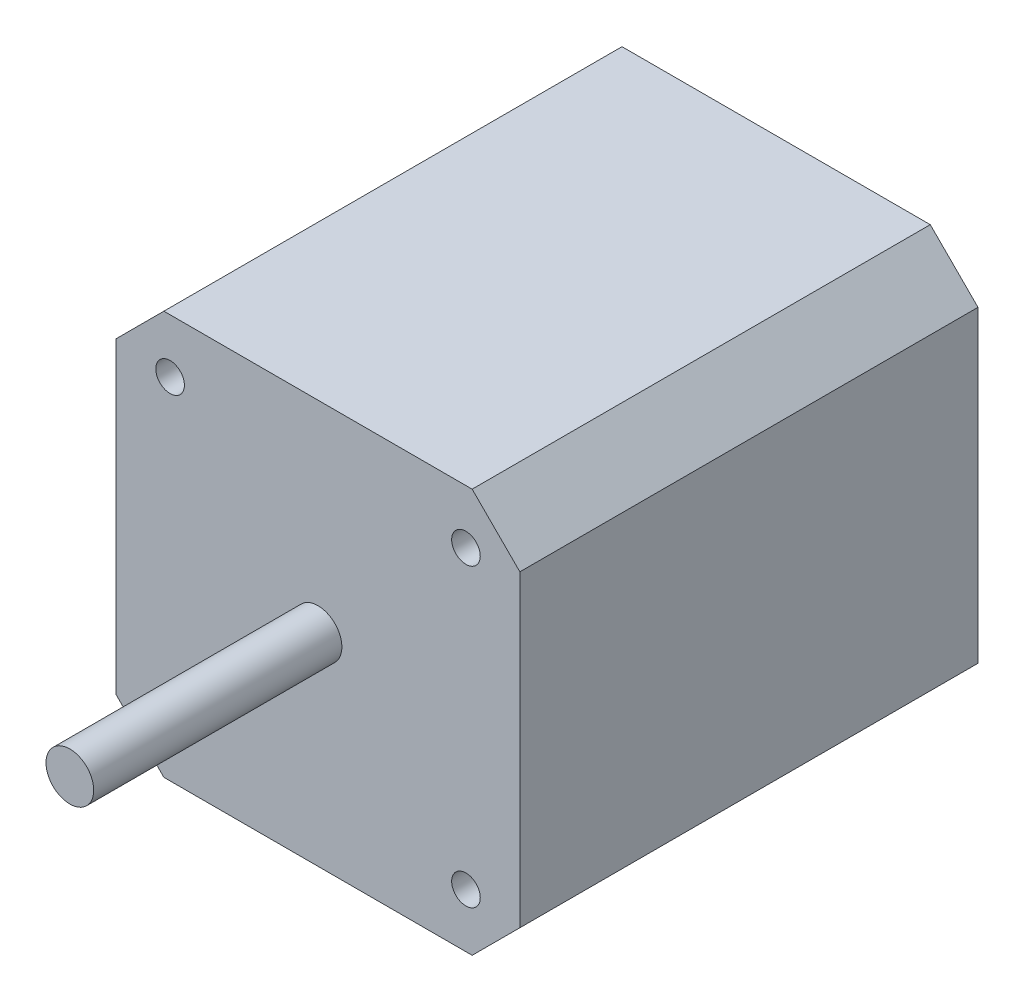
ISO-10303-21;
HEADER;
FILE_DESCRIPTION(('STEP AP214'),'2;1');
FILE_NAME('part.step','',(''),(''),'','','');
FILE_SCHEMA(('AUTOMOTIVE_DESIGN { 1 0 10303 214 1 1 1 1 }'));
ENDSEC;
DATA;
#1=APPLICATION_CONTEXT('core data for automotive mechanical design processes');
#2=APPLICATION_PROTOCOL_DEFINITION('international standard','automotive_design',2000,#1);
#3=PRODUCT_CONTEXT('',#1,'mechanical');
#4=PRODUCT('Part','Part','',(#3));
#5=PRODUCT_RELATED_PRODUCT_CATEGORY('part','',(#4));
#6=PRODUCT_DEFINITION_FORMATION('','',#4);
#7=PRODUCT_DEFINITION_CONTEXT('part definition',#1,'design');
#8=PRODUCT_DEFINITION('design','',#6,#7);
#9=PRODUCT_DEFINITION_SHAPE('','',#8);
#10=(LENGTH_UNIT() NAMED_UNIT(*) SI_UNIT(.MILLI.,.METRE.));
#11=(NAMED_UNIT(*) PLANE_ANGLE_UNIT() SI_UNIT($,.RADIAN.));
#12=(NAMED_UNIT(*) SI_UNIT($,.STERADIAN.) SOLID_ANGLE_UNIT());
#13=UNCERTAINTY_MEASURE_WITH_UNIT(LENGTH_MEASURE(1.E-05),#10,'distance_accuracy_value','');
#14=(GEOMETRIC_REPRESENTATION_CONTEXT(3) GLOBAL_UNCERTAINTY_ASSIGNED_CONTEXT((#13)) GLOBAL_UNIT_ASSIGNED_CONTEXT((#10,
#11,#12)) REPRESENTATION_CONTEXT('',''));
#15=CARTESIAN_POINT('',(0.,0.,0.));
#16=DIRECTION('',(0.,0.,1.));
#17=DIRECTION('',(1.,0.,0.));
#18=AXIS2_PLACEMENT_3D('',#15,#16,#17);
#19=CARTESIAN_POINT('',(-21.15,-21.15,48.));
#20=DIRECTION('',(0.,1.,0.));
#21=DIRECTION('',(0.,0.,1.));
#22=AXIS2_PLACEMENT_3D('',#19,#20,#21);
#23=PLANE('',#22);
#24=DIRECTION('',(0.,0.,-1.));
#25=VECTOR('',#24,1.);
#26=CARTESIAN_POINT('',(-1.14999999999997,-21.15,5.));
#27=LINE('',#26,#25);
#28=CARTESIAN_POINT('',(-1.14999999999997,-21.15,5.));
#29=VERTEX_POINT('',#28);
#30=CARTESIAN_POINT('',(-1.14999999999997,-21.15,0.));
#31=VERTEX_POINT('',#30);
#32=EDGE_CURVE('E144',#29,#31,#27,.T.);
#33=ORIENTED_EDGE('',*,*,#32,.F.);
#34=DIRECTION('',(1.,0.,0.));
#35=VECTOR('',#34,1.);
#36=CARTESIAN_POINT('',(1.14999999999997,-21.15,5.));
#37=LINE('',#36,#35);
#38=CARTESIAN_POINT('',(1.14999999999997,-21.15,5.));
#39=VERTEX_POINT('',#38);
#40=EDGE_CURVE('E130',#29,#39,#37,.T.);
#41=ORIENTED_EDGE('',*,*,#40,.T.);
#42=DIRECTION('',(0.,0.,-1.));
#43=VECTOR('',#42,1.);
#44=CARTESIAN_POINT('',(1.14999999999997,-21.15,5.));
#45=LINE('',#44,#43);
#46=CARTESIAN_POINT('',(1.14999999999997,-21.15,0.));
#47=VERTEX_POINT('',#46);
#48=EDGE_CURVE('E153',#39,#47,#45,.T.);
#49=ORIENTED_EDGE('',*,*,#48,.T.);
#50=DIRECTION('',(1.,0.,0.));
#51=VECTOR('',#50,1.);
#52=CARTESIAN_POINT('',(-21.15,-21.15,0.));
#53=LINE('',#52,#51);
#54=CARTESIAN_POINT('',(16.15,-21.15,0.));
#55=VERTEX_POINT('',#54);
#56=EDGE_CURVE('E184',#47,#55,#53,.T.);
#57=ORIENTED_EDGE('',*,*,#56,.T.);
#58=DIRECTION('',(0.,0.,1.));
#59=VECTOR('',#58,1.);
#60=CARTESIAN_POINT('',(16.15,-21.15,48.));
#61=LINE('',#60,#59);
#62=CARTESIAN_POINT('',(16.15,-21.15,48.));
#63=VERTEX_POINT('',#62);
#64=EDGE_CURVE('E201',#55,#63,#61,.T.);
#65=ORIENTED_EDGE('',*,*,#64,.T.);
#66=DIRECTION('',(1.,0.,0.));
#67=VECTOR('',#66,1.);
#68=CARTESIAN_POINT('',(-21.15,-21.15,48.));
#69=LINE('',#68,#67);
#70=CARTESIAN_POINT('',(-16.15,-21.15,48.));
#71=VERTEX_POINT('',#70);
#72=EDGE_CURVE('E173',#71,#63,#69,.T.);
#73=ORIENTED_EDGE('',*,*,#72,.F.);
#74=DIRECTION('',(0.,0.,-1.));
#75=VECTOR('',#74,1.);
#76=CARTESIAN_POINT('',(-16.15,-21.15,48.));
#77=LINE('',#76,#75);
#78=CARTESIAN_POINT('',(-16.15,-21.15,0.));
#79=VERTEX_POINT('',#78);
#80=EDGE_CURVE('E199',#71,#79,#77,.T.);
#81=ORIENTED_EDGE('',*,*,#80,.T.);
#82=EDGE_CURVE('E152',#79,#31,#53,.T.);
#83=ORIENTED_EDGE('',*,*,#82,.T.);
#84=EDGE_LOOP('',(#33,#41,#49,#57,#65,#73,#81,#83));
#85=FACE_BOUND('',#84,.T.);
#86=ADVANCED_FACE('F37',(#85),#23,.F.);
#87=CARTESIAN_POINT('',(21.15,-21.15,48.));
#88=DIRECTION('',(-1.,0.,0.));
#89=DIRECTION('',(0.,0.,1.));
#90=AXIS2_PLACEMENT_3D('',#87,#88,#89);
#91=PLANE('',#90);
#92=DIRECTION('',(0.,1.,0.));
#93=VECTOR('',#92,1.);
#94=CARTESIAN_POINT('',(21.15,-21.15,48.));
#95=LINE('',#94,#93);
#96=CARTESIAN_POINT('',(21.15,-16.15,48.));
#97=VERTEX_POINT('',#96);
#98=CARTESIAN_POINT('',(21.15,16.15,48.));
#99=VERTEX_POINT('',#98);
#100=EDGE_CURVE('E165',#97,#99,#95,.T.);
#101=ORIENTED_EDGE('',*,*,#100,.F.);
#102=DIRECTION('',(0.,0.,-1.));
#103=VECTOR('',#102,1.);
#104=CARTESIAN_POINT('',(21.15,-16.15,48.));
#105=LINE('',#104,#103);
#106=CARTESIAN_POINT('',(21.15,-16.15,0.));
#107=VERTEX_POINT('',#106);
#108=EDGE_CURVE('E187',#97,#107,#105,.T.);
#109=ORIENTED_EDGE('',*,*,#108,.T.);
#110=DIRECTION('',(0.,1.,0.));
#111=VECTOR('',#110,1.);
#112=CARTESIAN_POINT('',(21.15,-21.15,0.));
#113=LINE('',#112,#111);
#114=CARTESIAN_POINT('',(21.15,16.15,0.));
#115=VERTEX_POINT('',#114);
#116=EDGE_CURVE('E164',#107,#115,#113,.T.);
#117=ORIENTED_EDGE('',*,*,#116,.T.);
#118=DIRECTION('',(0.,0.,1.));
#119=VECTOR('',#118,1.);
#120=CARTESIAN_POINT('',(21.15,16.15,48.));
#121=LINE('',#120,#119);
#122=EDGE_CURVE('E176',#115,#99,#121,.T.);
#123=ORIENTED_EDGE('',*,*,#122,.T.);
#124=EDGE_LOOP('',(#101,#109,#117,#123));
#125=FACE_BOUND('',#124,.T.);
#126=ADVANCED_FACE('F247',(#125),#91,.F.);
#127=CARTESIAN_POINT('',(-21.15,21.15,48.));
#128=DIRECTION('',(0.,-1.,0.));
#129=DIRECTION('',(0.,0.,-1.));
#130=AXIS2_PLACEMENT_3D('',#127,#128,#129);
#131=PLANE('',#130);
#132=DIRECTION('',(-1.,0.,0.));
#133=VECTOR('',#132,1.);
#134=CARTESIAN_POINT('',(-21.15,21.15,0.));
#135=LINE('',#134,#133);
#136=CARTESIAN_POINT('',(16.15,21.15,0.));
#137=VERTEX_POINT('',#136);
#138=CARTESIAN_POINT('',(-16.15,21.15,0.));
#139=VERTEX_POINT('',#138);
#140=EDGE_CURVE('E179',#137,#139,#135,.T.);
#141=ORIENTED_EDGE('',*,*,#140,.T.);
#142=DIRECTION('',(0.,0.,1.));
#143=VECTOR('',#142,1.);
#144=CARTESIAN_POINT('',(-16.15,21.15,48.));
#145=LINE('',#144,#143);
#146=CARTESIAN_POINT('',(-16.15,21.15,48.));
#147=VERTEX_POINT('',#146);
#148=EDGE_CURVE('E46',#139,#147,#145,.T.);
#149=ORIENTED_EDGE('',*,*,#148,.T.);
#150=DIRECTION('',(-1.,0.,0.));
#151=VECTOR('',#150,1.);
#152=CARTESIAN_POINT('',(-21.15,21.15,48.));
#153=LINE('',#152,#151);
#154=CARTESIAN_POINT('',(16.15,21.15,48.));
#155=VERTEX_POINT('',#154);
#156=EDGE_CURVE('E168',#155,#147,#153,.T.);
#157=ORIENTED_EDGE('',*,*,#156,.F.);
#158=DIRECTION('',(0.,0.,-1.));
#159=VECTOR('',#158,1.);
#160=CARTESIAN_POINT('',(16.15,21.15,48.));
#161=LINE('',#160,#159);
#162=EDGE_CURVE('E215',#155,#137,#161,.T.);
#163=ORIENTED_EDGE('',*,*,#162,.T.);
#164=EDGE_LOOP('',(#141,#149,#157,#163));
#165=FACE_BOUND('',#164,.T.);
#166=ADVANCED_FACE('F220',(#165),#131,.F.);
#167=CARTESIAN_POINT('',(-21.15,-21.15,48.));
#168=DIRECTION('',(1.,0.,0.));
#169=DIRECTION('',(0.,0.,-1.));
#170=AXIS2_PLACEMENT_3D('',#167,#168,#169);
#171=PLANE('',#170);
#172=DIRECTION('',(0.,-1.,0.));
#173=VECTOR('',#172,1.);
#174=CARTESIAN_POINT('',(-21.15,-21.15,0.));
#175=LINE('',#174,#173);
#176=CARTESIAN_POINT('',(-21.15,16.15,0.));
#177=VERTEX_POINT('',#176);
#178=CARTESIAN_POINT('',(-21.15,-16.15,0.));
#179=VERTEX_POINT('',#178);
#180=EDGE_CURVE('E182',#177,#179,#175,.T.);
#181=ORIENTED_EDGE('',*,*,#180,.T.);
#182=DIRECTION('',(0.,0.,1.));
#183=VECTOR('',#182,1.);
#184=CARTESIAN_POINT('',(-21.15,-16.15,48.));
#185=LINE('',#184,#183);
#186=CARTESIAN_POINT('',(-21.15,-16.15,48.));
#187=VERTEX_POINT('',#186);
#188=EDGE_CURVE('E61',#179,#187,#185,.T.);
#189=ORIENTED_EDGE('',*,*,#188,.T.);
#190=DIRECTION('',(0.,-1.,0.));
#191=VECTOR('',#190,1.);
#192=CARTESIAN_POINT('',(-21.15,-21.15,48.));
#193=LINE('',#192,#191);
#194=CARTESIAN_POINT('',(-21.15,16.15,48.));
#195=VERTEX_POINT('',#194);
#196=EDGE_CURVE('E171',#195,#187,#193,.T.);
#197=ORIENTED_EDGE('',*,*,#196,.F.);
#198=DIRECTION('',(0.,0.,-1.));
#199=VECTOR('',#198,1.);
#200=CARTESIAN_POINT('',(-21.15,16.15,48.));
#201=LINE('',#200,#199);
#202=EDGE_CURVE('E211',#195,#177,#201,.T.);
#203=ORIENTED_EDGE('',*,*,#202,.T.);
#204=EDGE_LOOP('',(#181,#189,#197,#203));
#205=FACE_BOUND('',#204,.T.);
#206=ADVANCED_FACE('F231',(#205),#171,.F.);
#207=CARTESIAN_POINT('',(0.,0.,48.));
#208=DIRECTION('',(0.,0.,-1.));
#209=DIRECTION('',(-1.,0.,0.));
#210=AXIS2_PLACEMENT_3D('',#207,#208,#209);
#211=PLANE('',#210);
#212=CARTESIAN_POINT('',(15.5,15.5,48.));
#213=DIRECTION('',(0.,0.,1.));
#214=DIRECTION('',(1.,0.,0.));
#215=AXIS2_PLACEMENT_3D('',#212,#213,#214);
#216=CIRCLE('',#215,1.5);
#217=CARTESIAN_POINT('',(17.,15.5,48.));
#218=VERTEX_POINT('',#217);
#219=EDGE_CURVE('E459',#218,#218,#216,.T.);
#220=ORIENTED_EDGE('',*,*,#219,.F.);
#221=EDGE_LOOP('',(#220));
#222=FACE_BOUND('',#221,.T.);
#223=CARTESIAN_POINT('',(15.5,-15.5,48.));
#224=DIRECTION('',(0.,0.,1.));
#225=DIRECTION('',(1.,0.,0.));
#226=AXIS2_PLACEMENT_3D('',#223,#224,#225);
#227=CIRCLE('',#226,1.5);
#228=CARTESIAN_POINT('',(17.,-15.5,48.));
#229=VERTEX_POINT('',#228);
#230=EDGE_CURVE('E458',#229,#229,#227,.T.);
#231=ORIENTED_EDGE('',*,*,#230,.F.);
#232=EDGE_LOOP('',(#231));
#233=FACE_BOUND('',#232,.T.);
#234=CARTESIAN_POINT('',(-15.5,-15.5,48.));
#235=DIRECTION('',(0.,0.,1.));
#236=DIRECTION('',(1.,0.,0.));
#237=AXIS2_PLACEMENT_3D('',#234,#235,#236);
#238=CIRCLE('',#237,1.5);
#239=CARTESIAN_POINT('',(-14.,-15.5,48.));
#240=VERTEX_POINT('',#239);
#241=EDGE_CURVE('E485',#240,#240,#238,.T.);
#242=ORIENTED_EDGE('',*,*,#241,.F.);
#243=EDGE_LOOP('',(#242));
#244=FACE_BOUND('',#243,.T.);
#245=CARTESIAN_POINT('',(-15.5,15.5,48.));
#246=DIRECTION('',(0.,0.,1.));
#247=DIRECTION('',(1.,0.,0.));
#248=AXIS2_PLACEMENT_3D('',#245,#246,#247);
#249=CIRCLE('',#248,1.5);
#250=CARTESIAN_POINT('',(-14.,15.5,48.));
#251=VERTEX_POINT('',#250);
#252=EDGE_CURVE('E472',#251,#251,#249,.T.);
#253=ORIENTED_EDGE('',*,*,#252,.F.);
#254=EDGE_LOOP('',(#253));
#255=FACE_BOUND('',#254,.T.);
#256=CARTESIAN_POINT('',(0.,0.,48.));
#257=DIRECTION('',(0.,0.,-1.));
#258=DIRECTION('',(-1.,0.,0.));
#259=AXIS2_PLACEMENT_3D('',#256,#257,#258);
#260=CIRCLE('',#259,2.5);
#261=CARTESIAN_POINT('',(-2.5,0.,48.));
#262=VERTEX_POINT('',#261);
#263=EDGE_CURVE('E11',#262,#262,#260,.F.);
#264=ORIENTED_EDGE('',*,*,#263,.F.);
#265=EDGE_LOOP('',(#264));
#266=FACE_BOUND('',#265,.T.);
#267=ORIENTED_EDGE('',*,*,#72,.T.);
#268=DIRECTION('',(-0.707106781186549,-0.707106781186546,0.));
#269=VECTOR('',#268,1.);
#270=CARTESIAN_POINT('',(21.15,-16.15,48.));
#271=LINE('',#270,#269);
#272=EDGE_CURVE('E209',#63,#97,#271,.F.);
#273=ORIENTED_EDGE('',*,*,#272,.T.);
#274=ORIENTED_EDGE('',*,*,#100,.T.);
#275=DIRECTION('',(0.707106781186546,-0.707106781186549,0.));
#276=VECTOR('',#275,1.);
#277=CARTESIAN_POINT('',(16.15,21.15,48.));
#278=LINE('',#277,#276);
#279=EDGE_CURVE('E203',#99,#155,#278,.F.);
#280=ORIENTED_EDGE('',*,*,#279,.T.);
#281=ORIENTED_EDGE('',*,*,#156,.T.);
#282=DIRECTION('',(0.707106781186549,0.707106781186546,0.));
#283=VECTOR('',#282,1.);
#284=CARTESIAN_POINT('',(-21.15,16.15,48.));
#285=LINE('',#284,#283);
#286=EDGE_CURVE('E205',#147,#195,#285,.F.);
#287=ORIENTED_EDGE('',*,*,#286,.T.);
#288=ORIENTED_EDGE('',*,*,#196,.T.);
#289=DIRECTION('',(-0.707106781186546,0.707106781186549,0.));
#290=VECTOR('',#289,1.);
#291=CARTESIAN_POINT('',(-16.15,-21.15,48.));
#292=LINE('',#291,#290);
#293=EDGE_CURVE('E207',#187,#71,#292,.F.);
#294=ORIENTED_EDGE('',*,*,#293,.T.);
#295=EDGE_LOOP('',(#267,#273,#274,#280,#281,#287,#288,#294));
#296=FACE_BOUND('',#295,.T.);
#297=ADVANCED_FACE('F226',(#222,#233,#244,#255,#266,#296),#211,.F.);
#298=CARTESIAN_POINT('',(0.,0.,0.));
#299=DIRECTION('',(0.,0.,-1.));
#300=DIRECTION('',(-1.,0.,0.));
#301=AXIS2_PLACEMENT_3D('',#298,#299,#300);
#302=PLANE('',#301);
#303=ORIENTED_EDGE('',*,*,#116,.F.);
#304=DIRECTION('',(0.707106781186549,0.707106781186546,0.));
#305=VECTOR('',#304,1.);
#306=CARTESIAN_POINT('',(18.65,-18.65,0.));
#307=LINE('',#306,#305);
#308=EDGE_CURVE('E196',#107,#55,#307,.F.);
#309=ORIENTED_EDGE('',*,*,#308,.T.);
#310=ORIENTED_EDGE('',*,*,#56,.F.);
#311=DIRECTION('',(0.,-1.,0.));
#312=VECTOR('',#311,1.);
#313=CARTESIAN_POINT('',(1.14999999999997,-21.15,0.));
#314=LINE('',#313,#312);
#315=CARTESIAN_POINT('',(1.14999999999997,-36.15,0.));
#316=VERTEX_POINT('',#315);
#317=EDGE_CURVE('E53',#47,#316,#314,.T.);
#318=ORIENTED_EDGE('',*,*,#317,.T.);
#319=DIRECTION('',(-1.,0.,0.));
#320=VECTOR('',#319,1.);
#321=CARTESIAN_POINT('',(1.14999999999997,-36.15,0.));
#322=LINE('',#321,#320);
#323=CARTESIAN_POINT('',(-1.14999999999998,-36.15,0.));
#324=VERTEX_POINT('',#323);
#325=EDGE_CURVE('E147',#316,#324,#322,.T.);
#326=ORIENTED_EDGE('',*,*,#325,.T.);
#327=DIRECTION('',(0.,1.,0.));
#328=VECTOR('',#327,1.);
#329=CARTESIAN_POINT('',(-1.14999999999997,-21.15,0.));
#330=LINE('',#329,#328);
#331=EDGE_CURVE('E471',#324,#31,#330,.T.);
#332=ORIENTED_EDGE('',*,*,#331,.T.);
#333=ORIENTED_EDGE('',*,*,#82,.F.);
#334=DIRECTION('',(0.707106781186546,-0.707106781186549,0.));
#335=VECTOR('',#334,1.);
#336=CARTESIAN_POINT('',(-18.65,-18.65,0.));
#337=LINE('',#336,#335);
#338=EDGE_CURVE('E194',#79,#179,#337,.F.);
#339=ORIENTED_EDGE('',*,*,#338,.T.);
#340=ORIENTED_EDGE('',*,*,#180,.F.);
#341=DIRECTION('',(-0.707106781186549,-0.707106781186546,0.));
#342=VECTOR('',#341,1.);
#343=CARTESIAN_POINT('',(-18.65,18.65,0.));
#344=LINE('',#343,#342);
#345=EDGE_CURVE('E192',#177,#139,#344,.F.);
#346=ORIENTED_EDGE('',*,*,#345,.T.);
#347=ORIENTED_EDGE('',*,*,#140,.F.);
#348=DIRECTION('',(-0.707106781186546,0.707106781186549,0.));
#349=VECTOR('',#348,1.);
#350=CARTESIAN_POINT('',(18.65,18.65,0.));
#351=LINE('',#350,#349);
#352=EDGE_CURVE('E190',#137,#115,#351,.F.);
#353=ORIENTED_EDGE('',*,*,#352,.T.);
#354=EDGE_LOOP('',(#303,#309,#310,#318,#326,#332,#333,#339,#340,#346,#347,#353));
#355=FACE_BOUND('',#354,.T.);
#356=ADVANCED_FACE('F234',(#355),#302,.T.);
#357=CARTESIAN_POINT('',(21.15,-16.15,48.));
#358=DIRECTION('',(-0.707106781186546,0.707106781186549,0.));
#359=DIRECTION('',(0.,0.,-1.));
#360=AXIS2_PLACEMENT_3D('',#357,#358,#359);
#361=PLANE('',#360);
#362=ORIENTED_EDGE('',*,*,#272,.F.);
#363=ORIENTED_EDGE('',*,*,#64,.F.);
#364=ORIENTED_EDGE('',*,*,#308,.F.);
#365=ORIENTED_EDGE('',*,*,#108,.F.);
#366=EDGE_LOOP('',(#362,#363,#364,#365));
#367=FACE_BOUND('',#366,.T.);
#368=ADVANCED_FACE('F245',(#367),#361,.F.);
#369=CARTESIAN_POINT('',(-16.15,-21.15,48.));
#370=DIRECTION('',(0.707106781186549,0.707106781186546,0.));
#371=DIRECTION('',(0.,0.,-1.));
#372=AXIS2_PLACEMENT_3D('',#369,#370,#371);
#373=PLANE('',#372);
#374=ORIENTED_EDGE('',*,*,#293,.F.);
#375=ORIENTED_EDGE('',*,*,#188,.F.);
#376=ORIENTED_EDGE('',*,*,#338,.F.);
#377=ORIENTED_EDGE('',*,*,#80,.F.);
#378=EDGE_LOOP('',(#374,#375,#376,#377));
#379=FACE_BOUND('',#378,.T.);
#380=ADVANCED_FACE('F238',(#379),#373,.F.);
#381=CARTESIAN_POINT('',(-21.15,16.15,48.));
#382=DIRECTION('',(0.707106781186546,-0.707106781186549,0.));
#383=DIRECTION('',(0.,0.,-1.));
#384=AXIS2_PLACEMENT_3D('',#381,#382,#383);
#385=PLANE('',#384);
#386=ORIENTED_EDGE('',*,*,#286,.F.);
#387=ORIENTED_EDGE('',*,*,#148,.F.);
#388=ORIENTED_EDGE('',*,*,#345,.F.);
#389=ORIENTED_EDGE('',*,*,#202,.F.);
#390=EDGE_LOOP('',(#386,#387,#388,#389));
#391=FACE_BOUND('',#390,.T.);
#392=ADVANCED_FACE('F229',(#391),#385,.F.);
#393=CARTESIAN_POINT('',(16.15,21.15,48.));
#394=DIRECTION('',(-0.707106781186549,-0.707106781186546,0.));
#395=DIRECTION('',(0.,0.,-1.));
#396=AXIS2_PLACEMENT_3D('',#393,#394,#395);
#397=PLANE('',#396);
#398=ORIENTED_EDGE('',*,*,#279,.F.);
#399=ORIENTED_EDGE('',*,*,#122,.F.);
#400=ORIENTED_EDGE('',*,*,#352,.F.);
#401=ORIENTED_EDGE('',*,*,#162,.F.);
#402=EDGE_LOOP('',(#398,#399,#400,#401));
#403=FACE_BOUND('',#402,.T.);
#404=ADVANCED_FACE('F40',(#403),#397,.F.);
#405=CARTESIAN_POINT('',(0.,0.,74.));
#406=DIRECTION('',(0.,0.,-1.));
#407=DIRECTION('',(-1.,0.,0.));
#408=AXIS2_PLACEMENT_3D('',#405,#406,#407);
#409=CYLINDRICAL_SURFACE('',#408,2.5);
#410=CARTESIAN_POINT('',(0.,0.,74.));
#411=DIRECTION('',(0.,0.,1.));
#412=DIRECTION('',(1.,0.,0.));
#413=AXIS2_PLACEMENT_3D('',#410,#411,#412);
#414=CIRCLE('',#413,2.5);
#415=CARTESIAN_POINT('',(2.5,0.,74.));
#416=VERTEX_POINT('',#415);
#417=EDGE_CURVE('E161',#416,#416,#414,.T.);
#418=ORIENTED_EDGE('',*,*,#417,.F.);
#419=EDGE_LOOP('',(#418));
#420=FACE_BOUND('',#419,.T.);
#421=ORIENTED_EDGE('',*,*,#263,.T.);
#422=EDGE_LOOP('',(#421));
#423=FACE_BOUND('',#422,.T.);
#424=ADVANCED_FACE('F252',(#420,#423),#409,.T.);
#425=CARTESIAN_POINT('',(0.,0.,74.));
#426=DIRECTION('',(0.,0.,1.));
#427=DIRECTION('',(1.,0.,0.));
#428=AXIS2_PLACEMENT_3D('',#425,#426,#427);
#429=PLANE('',#428);
#430=ORIENTED_EDGE('',*,*,#417,.T.);
#431=EDGE_LOOP('',(#430));
#432=FACE_BOUND('',#431,.T.);
#433=ADVANCED_FACE('F257',(#432),#429,.T.);
#434=CARTESIAN_POINT('',(-1.14999999999997,-21.15,5.));
#435=DIRECTION('',(-1.,0.,0.));
#436=DIRECTION('',(0.,-1.,0.));
#437=AXIS2_PLACEMENT_3D('',#434,#435,#436);
#438=PLANE('',#437);
#439=ORIENTED_EDGE('',*,*,#331,.F.);
#440=DIRECTION('',(0.,0.,-1.));
#441=VECTOR('',#440,1.);
#442=CARTESIAN_POINT('',(-1.14999999999998,-36.15,5.));
#443=LINE('',#442,#441);
#444=CARTESIAN_POINT('',(-1.14999999999998,-36.15,5.));
#445=VERTEX_POINT('',#444);
#446=EDGE_CURVE('E146',#445,#324,#443,.T.);
#447=ORIENTED_EDGE('',*,*,#446,.F.);
#448=DIRECTION('',(0.,1.,0.));
#449=VECTOR('',#448,1.);
#450=CARTESIAN_POINT('',(-1.14999999999997,-21.15,5.));
#451=LINE('',#450,#449);
#452=EDGE_CURVE('E134',#445,#29,#451,.T.);
#453=ORIENTED_EDGE('',*,*,#452,.T.);
#454=ORIENTED_EDGE('',*,*,#32,.T.);
#455=EDGE_LOOP('',(#439,#447,#453,#454));
#456=FACE_BOUND('',#455,.T.);
#457=ADVANCED_FACE('F143',(#456),#438,.T.);
#458=CARTESIAN_POINT('',(1.14999999999997,-36.15,5.));
#459=DIRECTION('',(0.,-1.,0.));
#460=DIRECTION('',(0.,0.,-1.));
#461=AXIS2_PLACEMENT_3D('',#458,#459,#460);
#462=PLANE('',#461);
#463=ORIENTED_EDGE('',*,*,#325,.F.);
#464=DIRECTION('',(0.,0.,-1.));
#465=VECTOR('',#464,1.);
#466=CARTESIAN_POINT('',(1.14999999999997,-36.15,5.));
#467=LINE('',#466,#465);
#468=CARTESIAN_POINT('',(1.14999999999997,-36.15,5.));
#469=VERTEX_POINT('',#468);
#470=EDGE_CURVE('E156',#469,#316,#467,.T.);
#471=ORIENTED_EDGE('',*,*,#470,.F.);
#472=DIRECTION('',(-1.,0.,0.));
#473=VECTOR('',#472,1.);
#474=CARTESIAN_POINT('',(1.14999999999997,-36.15,5.));
#475=LINE('',#474,#473);
#476=EDGE_CURVE('E154',#469,#445,#475,.T.);
#477=ORIENTED_EDGE('',*,*,#476,.T.);
#478=ORIENTED_EDGE('',*,*,#446,.T.);
#479=EDGE_LOOP('',(#463,#471,#477,#478));
#480=FACE_BOUND('',#479,.T.);
#481=ADVANCED_FACE('F337',(#480),#462,.T.);
#482=CARTESIAN_POINT('',(1.14999999999997,-21.15,5.));
#483=DIRECTION('',(1.,0.,0.));
#484=DIRECTION('',(0.,1.,0.));
#485=AXIS2_PLACEMENT_3D('',#482,#483,#484);
#486=PLANE('',#485);
#487=ORIENTED_EDGE('',*,*,#317,.F.);
#488=ORIENTED_EDGE('',*,*,#48,.F.);
#489=DIRECTION('',(0.,-1.,0.));
#490=VECTOR('',#489,1.);
#491=CARTESIAN_POINT('',(1.14999999999997,-21.15,5.));
#492=LINE('',#491,#490);
#493=EDGE_CURVE('E137',#39,#469,#492,.T.);
#494=ORIENTED_EDGE('',*,*,#493,.T.);
#495=ORIENTED_EDGE('',*,*,#470,.T.);
#496=EDGE_LOOP('',(#487,#488,#494,#495));
#497=FACE_BOUND('',#496,.T.);
#498=ADVANCED_FACE('F346',(#497),#486,.T.);
#499=CARTESIAN_POINT('',(0.,0.,5.));
#500=DIRECTION('',(0.,0.,-1.));
#501=DIRECTION('',(-1.,0.,0.));
#502=AXIS2_PLACEMENT_3D('',#499,#500,#501);
#503=PLANE('',#502);
#504=ORIENTED_EDGE('',*,*,#452,.F.);
#505=ORIENTED_EDGE('',*,*,#476,.F.);
#506=ORIENTED_EDGE('',*,*,#493,.F.);
#507=ORIENTED_EDGE('',*,*,#40,.F.);
#508=EDGE_LOOP('',(#504,#505,#506,#507));
#509=FACE_BOUND('',#508,.T.);
#510=ADVANCED_FACE('F132',(#509),#503,.F.);
#511=CARTESIAN_POINT('',(-15.5,15.5,43.));
#512=DIRECTION('',(0.,0.,1.));
#513=DIRECTION('',(1.,0.,0.));
#514=AXIS2_PLACEMENT_3D('',#511,#512,#513);
#515=CYLINDRICAL_SURFACE('',#514,1.5);
#516=CARTESIAN_POINT('',(-15.5,15.5,43.));
#517=DIRECTION('',(0.,0.,1.));
#518=DIRECTION('',(1.,0.,0.));
#519=AXIS2_PLACEMENT_3D('',#516,#517,#518);
#520=CIRCLE('',#519,1.5);
#521=CARTESIAN_POINT('',(-14.,15.5,43.));
#522=VERTEX_POINT('',#521);
#523=EDGE_CURVE('E468',#522,#522,#520,.T.);
#524=ORIENTED_EDGE('',*,*,#523,.F.);
#525=EDGE_LOOP('',(#524));
#526=FACE_BOUND('',#525,.T.);
#527=ORIENTED_EDGE('',*,*,#252,.T.);
#528=EDGE_LOOP('',(#527));
#529=FACE_BOUND('',#528,.T.);
#530=ADVANCED_FACE('F364',(#526,#529),#515,.F.);
#531=CARTESIAN_POINT('',(-15.5,15.5,43.));
#532=DIRECTION('',(0.,0.,1.));
#533=DIRECTION('',(1.,0.,0.));
#534=AXIS2_PLACEMENT_3D('',#531,#532,#533);
#535=PLANE('',#534);
#536=ORIENTED_EDGE('',*,*,#523,.T.);
#537=EDGE_LOOP('',(#536));
#538=FACE_BOUND('',#537,.T.);
#539=ADVANCED_FACE('F381',(#538),#535,.T.);
#540=CARTESIAN_POINT('',(-15.5,-15.5,43.));
#541=DIRECTION('',(0.,0.,1.));
#542=DIRECTION('',(1.,0.,0.));
#543=AXIS2_PLACEMENT_3D('',#540,#541,#542);
#544=CYLINDRICAL_SURFACE('',#543,1.5);
#545=CARTESIAN_POINT('',(-15.5,-15.5,43.));
#546=DIRECTION('',(0.,0.,1.));
#547=DIRECTION('',(1.,0.,0.));
#548=AXIS2_PLACEMENT_3D('',#545,#546,#547);
#549=CIRCLE('',#548,1.5);
#550=CARTESIAN_POINT('',(-14.,-15.5,43.));
#551=VERTEX_POINT('',#550);
#552=EDGE_CURVE('E474',#551,#551,#549,.T.);
#553=ORIENTED_EDGE('',*,*,#552,.F.);
#554=EDGE_LOOP('',(#553));
#555=FACE_BOUND('',#554,.T.);
#556=ORIENTED_EDGE('',*,*,#241,.T.);
#557=EDGE_LOOP('',(#556));
#558=FACE_BOUND('',#557,.T.);
#559=ADVANCED_FACE('F391',(#555,#558),#544,.F.);
#560=CARTESIAN_POINT('',(-15.5,-15.5,43.));
#561=DIRECTION('',(0.,0.,1.));
#562=DIRECTION('',(1.,0.,0.));
#563=AXIS2_PLACEMENT_3D('',#560,#561,#562);
#564=PLANE('',#563);
#565=ORIENTED_EDGE('',*,*,#552,.T.);
#566=EDGE_LOOP('',(#565));
#567=FACE_BOUND('',#566,.T.);
#568=ADVANCED_FACE('F401',(#567),#564,.T.);
#569=CARTESIAN_POINT('',(15.5,-15.5,43.));
#570=DIRECTION('',(0.,0.,1.));
#571=DIRECTION('',(1.,0.,0.));
#572=AXIS2_PLACEMENT_3D('',#569,#570,#571);
#573=CYLINDRICAL_SURFACE('',#572,1.5);
#574=CARTESIAN_POINT('',(15.5,-15.5,43.));
#575=DIRECTION('',(0.,0.,1.));
#576=DIRECTION('',(1.,0.,0.));
#577=AXIS2_PLACEMENT_3D('',#574,#575,#576);
#578=CIRCLE('',#577,1.5);
#579=CARTESIAN_POINT('',(17.,-15.5,43.));
#580=VERTEX_POINT('',#579);
#581=EDGE_CURVE('E462',#580,#580,#578,.T.);
#582=ORIENTED_EDGE('',*,*,#581,.F.);
#583=EDGE_LOOP('',(#582));
#584=FACE_BOUND('',#583,.T.);
#585=ORIENTED_EDGE('',*,*,#230,.T.);
#586=EDGE_LOOP('',(#585));
#587=FACE_BOUND('',#586,.T.);
#588=ADVANCED_FACE('F411',(#584,#587),#573,.F.);
#589=CARTESIAN_POINT('',(15.5,-15.5,43.));
#590=DIRECTION('',(0.,0.,1.));
#591=DIRECTION('',(1.,0.,0.));
#592=AXIS2_PLACEMENT_3D('',#589,#590,#591);
#593=PLANE('',#592);
#594=ORIENTED_EDGE('',*,*,#581,.T.);
#595=EDGE_LOOP('',(#594));
#596=FACE_BOUND('',#595,.T.);
#597=ADVANCED_FACE('F421',(#596),#593,.T.);
#598=CARTESIAN_POINT('',(15.5,15.5,43.));
#599=DIRECTION('',(0.,0.,1.));
#600=DIRECTION('',(1.,0.,0.));
#601=AXIS2_PLACEMENT_3D('',#598,#599,#600);
#602=CYLINDRICAL_SURFACE('',#601,1.5);
#603=CARTESIAN_POINT('',(15.5,15.5,43.));
#604=DIRECTION('',(0.,0.,1.));
#605=DIRECTION('',(1.,0.,0.));
#606=AXIS2_PLACEMENT_3D('',#603,#604,#605);
#607=CIRCLE('',#606,1.5);
#608=CARTESIAN_POINT('',(17.,15.5,43.));
#609=VERTEX_POINT('',#608);
#610=EDGE_CURVE('E457',#609,#609,#607,.T.);
#611=ORIENTED_EDGE('',*,*,#610,.F.);
#612=EDGE_LOOP('',(#611));
#613=FACE_BOUND('',#612,.T.);
#614=ORIENTED_EDGE('',*,*,#219,.T.);
#615=EDGE_LOOP('',(#614));
#616=FACE_BOUND('',#615,.T.);
#617=ADVANCED_FACE('F431',(#613,#616),#602,.F.);
#618=CARTESIAN_POINT('',(15.5,15.5,43.));
#619=DIRECTION('',(0.,0.,1.));
#620=DIRECTION('',(1.,0.,0.));
#621=AXIS2_PLACEMENT_3D('',#618,#619,#620);
#622=PLANE('',#621);
#623=ORIENTED_EDGE('',*,*,#610,.T.);
#624=EDGE_LOOP('',(#623));
#625=FACE_BOUND('',#624,.T.);
#626=ADVANCED_FACE('F441',(#625),#622,.T.);
#627=CLOSED_SHELL('',(#86,#126,#166,#206,#297,#356,#368,#380,#392,#404,#424,#433,#457,#481,#498,
#510,#530,#539,#559,#568,#588,#597,#617,#626));
#628=MANIFOLD_SOLID_BREP('B2',#627);
#629=ADVANCED_BREP_SHAPE_REPRESENTATION('',(#18,#628),#14);
#630=SHAPE_DEFINITION_REPRESENTATION(#9,#629);
ENDSEC;
END-ISO-10303-21;
